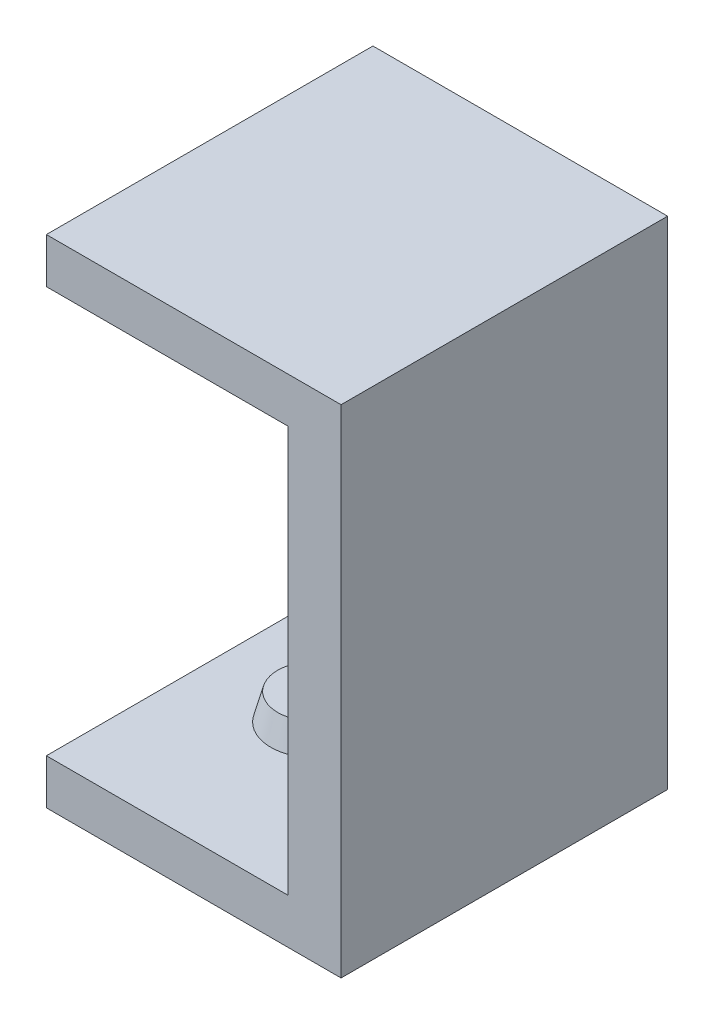
ISO-10303-21;
HEADER;
FILE_DESCRIPTION(('STEP AP214'),'2;1');
FILE_NAME('part.step','',(''),(''),'','','');
FILE_SCHEMA(('AUTOMOTIVE_DESIGN { 1 0 10303 214 1 1 1 1 }'));
ENDSEC;
DATA;
#1=APPLICATION_CONTEXT('core data for automotive mechanical design processes');
#2=APPLICATION_PROTOCOL_DEFINITION('international standard','automotive_design',2000,#1);
#3=PRODUCT_CONTEXT('',#1,'mechanical');
#4=PRODUCT('Part','Part','',(#3));
#5=PRODUCT_RELATED_PRODUCT_CATEGORY('part','',(#4));
#6=PRODUCT_DEFINITION_FORMATION('','',#4);
#7=PRODUCT_DEFINITION_CONTEXT('part definition',#1,'design');
#8=PRODUCT_DEFINITION('design','',#6,#7);
#9=PRODUCT_DEFINITION_SHAPE('','',#8);
#10=(LENGTH_UNIT() NAMED_UNIT(*) SI_UNIT(.MILLI.,.METRE.));
#11=(NAMED_UNIT(*) PLANE_ANGLE_UNIT() SI_UNIT($,.RADIAN.));
#12=(NAMED_UNIT(*) SI_UNIT($,.STERADIAN.) SOLID_ANGLE_UNIT());
#13=UNCERTAINTY_MEASURE_WITH_UNIT(LENGTH_MEASURE(1.E-05),#10,'distance_accuracy_value','');
#14=(GEOMETRIC_REPRESENTATION_CONTEXT(3) GLOBAL_UNCERTAINTY_ASSIGNED_CONTEXT((#13)) GLOBAL_UNIT_ASSIGNED_CONTEXT((#10,
#11,#12)) REPRESENTATION_CONTEXT('',''));
#15=CARTESIAN_POINT('',(0.,0.,0.));
#16=DIRECTION('',(0.,0.,1.));
#17=DIRECTION('',(1.,0.,0.));
#18=AXIS2_PLACEMENT_3D('',#15,#16,#17);
#19=CARTESIAN_POINT('',(0.,7.65,12.3));
#20=DIRECTION('',(0.,-1.,0.));
#21=DIRECTION('',(1.,0.,0.));
#22=AXIS2_PLACEMENT_3D('',#19,#20,#21);
#23=PLANE('',#22);
#24=DIRECTION('',(-1.,0.,0.));
#25=VECTOR('',#24,1.);
#26=CARTESIAN_POINT('',(0.,7.65,0.));
#27=LINE('',#26,#25);
#28=CARTESIAN_POINT('',(0.,7.65,0.));
#29=VERTEX_POINT('',#28);
#30=CARTESIAN_POINT('',(-9.1,7.65,0.));
#31=VERTEX_POINT('',#30);
#32=EDGE_CURVE('E142',#29,#31,#27,.T.);
#33=ORIENTED_EDGE('',*,*,#32,.F.);
#34=DIRECTION('',(0.,0.,-1.));
#35=VECTOR('',#34,1.);
#36=CARTESIAN_POINT('',(0.,7.65,12.3));
#37=LINE('',#36,#35);
#38=CARTESIAN_POINT('',(0.,7.65,12.3));
#39=VERTEX_POINT('',#38);
#40=EDGE_CURVE('E155',#39,#29,#37,.T.);
#41=ORIENTED_EDGE('',*,*,#40,.F.);
#42=DIRECTION('',(-1.,0.,0.));
#43=VECTOR('',#42,1.);
#44=CARTESIAN_POINT('',(0.,7.65,12.3));
#45=LINE('',#44,#43);
#46=CARTESIAN_POINT('',(-9.1,7.65,12.3));
#47=VERTEX_POINT('',#46);
#48=EDGE_CURVE('E212',#39,#47,#45,.T.);
#49=ORIENTED_EDGE('',*,*,#48,.T.);
#50=DIRECTION('',(0.,0.,-1.));
#51=VECTOR('',#50,1.);
#52=CARTESIAN_POINT('',(-9.1,7.65,12.3));
#53=LINE('',#52,#51);
#54=EDGE_CURVE('E157',#47,#31,#53,.T.);
#55=ORIENTED_EDGE('',*,*,#54,.T.);
#56=EDGE_LOOP('',(#33,#41,#49,#55));
#57=FACE_BOUND('',#56,.T.);
#58=CARTESIAN_POINT('',(-5.15,7.65,6.15));
#59=DIRECTION('',(0.,-1.,0.));
#60=DIRECTION('',(0.,0.,-1.));
#61=AXIS2_PLACEMENT_3D('',#58,#59,#60);
#62=CIRCLE('',#61,1.65);
#63=CARTESIAN_POINT('',(-5.15,7.65,4.5));
#64=VERTEX_POINT('',#63);
#65=EDGE_CURVE('E137',#64,#64,#62,.T.);
#66=ORIENTED_EDGE('',*,*,#65,.F.);
#67=EDGE_LOOP('',(#66));
#68=FACE_BOUND('',#67,.T.);
#69=ADVANCED_FACE('F35',(#57,#68),#23,.T.);
#70=CARTESIAN_POINT('',(2.,0.,12.3));
#71=DIRECTION('',(1.,0.,0.));
#72=DIRECTION('',(0.,0.,-1.));
#73=AXIS2_PLACEMENT_3D('',#70,#71,#72);
#74=PLANE('',#73);
#75=DIRECTION('',(0.,-1.,0.));
#76=VECTOR('',#75,1.);
#77=CARTESIAN_POINT('',(2.,0.,0.));
#78=LINE('',#77,#76);
#79=CARTESIAN_POINT('',(2.,9.35,0.));
#80=VERTEX_POINT('',#79);
#81=CARTESIAN_POINT('',(2.,-9.35,0.));
#82=VERTEX_POINT('',#81);
#83=EDGE_CURVE('E89',#80,#82,#78,.T.);
#84=ORIENTED_EDGE('',*,*,#83,.F.);
#85=DIRECTION('',(0.,0.,-1.));
#86=VECTOR('',#85,1.);
#87=CARTESIAN_POINT('',(2.,9.35,12.3));
#88=LINE('',#87,#86);
#89=CARTESIAN_POINT('',(2.,9.35,12.3));
#90=VERTEX_POINT('',#89);
#91=EDGE_CURVE('E161',#90,#80,#88,.T.);
#92=ORIENTED_EDGE('',*,*,#91,.F.);
#93=DIRECTION('',(0.,-1.,0.));
#94=VECTOR('',#93,1.);
#95=CARTESIAN_POINT('',(2.,0.,12.3));
#96=LINE('',#95,#94);
#97=CARTESIAN_POINT('',(2.,-9.35,12.3));
#98=VERTEX_POINT('',#97);
#99=EDGE_CURVE('E95',#90,#98,#96,.T.);
#100=ORIENTED_EDGE('',*,*,#99,.T.);
#101=DIRECTION('',(0.,0.,-1.));
#102=VECTOR('',#101,1.);
#103=CARTESIAN_POINT('',(2.,-9.35,12.3));
#104=LINE('',#103,#102);
#105=EDGE_CURVE('E131',#98,#82,#104,.T.);
#106=ORIENTED_EDGE('',*,*,#105,.T.);
#107=EDGE_LOOP('',(#84,#92,#100,#106));
#108=FACE_BOUND('',#107,.T.);
#109=ADVANCED_FACE('F182',(#108),#74,.T.);
#110=CARTESIAN_POINT('',(0.,9.35,12.3));
#111=DIRECTION('',(0.,1.,0.));
#112=DIRECTION('',(0.,0.,1.));
#113=AXIS2_PLACEMENT_3D('',#110,#111,#112);
#114=PLANE('',#113);
#115=DIRECTION('',(1.,0.,0.));
#116=VECTOR('',#115,1.);
#117=CARTESIAN_POINT('',(0.,9.35,0.));
#118=LINE('',#117,#116);
#119=CARTESIAN_POINT('',(-9.1,9.35,0.));
#120=VERTEX_POINT('',#119);
#121=EDGE_CURVE('E136',#120,#80,#118,.T.);
#122=ORIENTED_EDGE('',*,*,#121,.F.);
#123=DIRECTION('',(0.,0.,-1.));
#124=VECTOR('',#123,1.);
#125=CARTESIAN_POINT('',(-9.1,9.35,12.3));
#126=LINE('',#125,#124);
#127=CARTESIAN_POINT('',(-9.1,9.35,12.3));
#128=VERTEX_POINT('',#127);
#129=EDGE_CURVE('E159',#128,#120,#126,.T.);
#130=ORIENTED_EDGE('',*,*,#129,.F.);
#131=DIRECTION('',(1.,0.,0.));
#132=VECTOR('',#131,1.);
#133=CARTESIAN_POINT('',(0.,9.35,12.3));
#134=LINE('',#133,#132);
#135=EDGE_CURVE('E213',#128,#90,#134,.T.);
#136=ORIENTED_EDGE('',*,*,#135,.T.);
#137=ORIENTED_EDGE('',*,*,#91,.T.);
#138=EDGE_LOOP('',(#122,#130,#136,#137));
#139=FACE_BOUND('',#138,.T.);
#140=ADVANCED_FACE('F188',(#139),#114,.T.);
#141=CARTESIAN_POINT('',(-9.1,0.,12.3));
#142=DIRECTION('',(1.,0.,0.));
#143=DIRECTION('',(0.,0.,-1.));
#144=AXIS2_PLACEMENT_3D('',#141,#142,#143);
#145=PLANE('',#144);
#146=DIRECTION('',(0.,-1.,0.));
#147=VECTOR('',#146,1.);
#148=CARTESIAN_POINT('',(-9.1,0.,0.));
#149=LINE('',#148,#147);
#150=EDGE_CURVE('E139',#120,#31,#149,.T.);
#151=ORIENTED_EDGE('',*,*,#150,.T.);
#152=ORIENTED_EDGE('',*,*,#54,.F.);
#153=DIRECTION('',(0.,-1.,0.));
#154=VECTOR('',#153,1.);
#155=CARTESIAN_POINT('',(-9.1,0.,12.3));
#156=LINE('',#155,#154);
#157=EDGE_CURVE('E211',#128,#47,#156,.T.);
#158=ORIENTED_EDGE('',*,*,#157,.F.);
#159=ORIENTED_EDGE('',*,*,#129,.T.);
#160=EDGE_LOOP('',(#151,#152,#158,#159));
#161=FACE_BOUND('',#160,.T.);
#162=ADVANCED_FACE('F196',(#161),#145,.F.);
#163=CARTESIAN_POINT('',(0.,0.,12.3));
#164=DIRECTION('',(1.,0.,0.));
#165=DIRECTION('',(0.,0.,-1.));
#166=AXIS2_PLACEMENT_3D('',#163,#164,#165);
#167=PLANE('',#166);
#168=DIRECTION('',(0.,-1.,0.));
#169=VECTOR('',#168,1.);
#170=CARTESIAN_POINT('',(0.,0.,0.));
#171=LINE('',#170,#169);
#172=CARTESIAN_POINT('',(0.,-7.65,0.));
#173=VERTEX_POINT('',#172);
#174=EDGE_CURVE('E145',#29,#173,#171,.T.);
#175=ORIENTED_EDGE('',*,*,#174,.T.);
#176=DIRECTION('',(0.,0.,-1.));
#177=VECTOR('',#176,1.);
#178=CARTESIAN_POINT('',(0.,-7.65,12.3));
#179=LINE('',#178,#177);
#180=CARTESIAN_POINT('',(0.,-7.65,12.3));
#181=VERTEX_POINT('',#180);
#182=EDGE_CURVE('E126',#181,#173,#179,.T.);
#183=ORIENTED_EDGE('',*,*,#182,.F.);
#184=DIRECTION('',(0.,-1.,0.));
#185=VECTOR('',#184,1.);
#186=CARTESIAN_POINT('',(0.,0.,12.3));
#187=LINE('',#186,#185);
#188=EDGE_CURVE('E117',#39,#181,#187,.T.);
#189=ORIENTED_EDGE('',*,*,#188,.F.);
#190=ORIENTED_EDGE('',*,*,#40,.T.);
#191=EDGE_LOOP('',(#175,#183,#189,#190));
#192=FACE_BOUND('',#191,.T.);
#193=ADVANCED_FACE('F194',(#192),#167,.F.);
#194=CARTESIAN_POINT('',(0.,-7.65,12.3));
#195=DIRECTION('',(0.,-1.,0.));
#196=DIRECTION('',(1.,0.,0.));
#197=AXIS2_PLACEMENT_3D('',#194,#195,#196);
#198=PLANE('',#197);
#199=CARTESIAN_POINT('',(-5.15,-7.65,6.15));
#200=DIRECTION('',(0.,-1.,0.));
#201=DIRECTION('',(0.,0.,-1.));
#202=AXIS2_PLACEMENT_3D('',#199,#200,#201);
#203=CIRCLE('',#202,1.65);
#204=CARTESIAN_POINT('',(-5.15,-7.65,4.5));
#205=VERTEX_POINT('',#204);
#206=EDGE_CURVE('E238',#205,#205,#203,.T.);
#207=ORIENTED_EDGE('',*,*,#206,.T.);
#208=EDGE_LOOP('',(#207));
#209=FACE_BOUND('',#208,.T.);
#210=DIRECTION('',(-1.,0.,0.));
#211=VECTOR('',#210,1.);
#212=CARTESIAN_POINT('',(0.,-7.65,0.));
#213=LINE('',#212,#211);
#214=CARTESIAN_POINT('',(-9.1,-7.65,0.));
#215=VERTEX_POINT('',#214);
#216=EDGE_CURVE('E125',#173,#215,#213,.T.);
#217=ORIENTED_EDGE('',*,*,#216,.T.);
#218=DIRECTION('',(0.,0.,-1.));
#219=VECTOR('',#218,1.);
#220=CARTESIAN_POINT('',(-9.1,-7.65,12.3));
#221=LINE('',#220,#219);
#222=CARTESIAN_POINT('',(-9.1,-7.65,12.3));
#223=VERTEX_POINT('',#222);
#224=EDGE_CURVE('E122',#223,#215,#221,.T.);
#225=ORIENTED_EDGE('',*,*,#224,.F.);
#226=DIRECTION('',(-1.,0.,0.));
#227=VECTOR('',#226,1.);
#228=CARTESIAN_POINT('',(0.,-7.65,12.3));
#229=LINE('',#228,#227);
#230=EDGE_CURVE('E110',#181,#223,#229,.T.);
#231=ORIENTED_EDGE('',*,*,#230,.F.);
#232=ORIENTED_EDGE('',*,*,#182,.T.);
#233=EDGE_LOOP('',(#217,#225,#231,#232));
#234=FACE_BOUND('',#233,.T.);
#235=ADVANCED_FACE('F123',(#209,#234),#198,.F.);
#236=CARTESIAN_POINT('',(-9.1,0.,12.3));
#237=DIRECTION('',(1.,0.,0.));
#238=DIRECTION('',(0.,0.,-1.));
#239=AXIS2_PLACEMENT_3D('',#236,#237,#238);
#240=PLANE('',#239);
#241=DIRECTION('',(0.,-1.,0.));
#242=VECTOR('',#241,1.);
#243=CARTESIAN_POINT('',(-9.1,0.,0.));
#244=LINE('',#243,#242);
#245=CARTESIAN_POINT('',(-9.1,-9.35,0.));
#246=VERTEX_POINT('',#245);
#247=EDGE_CURVE('E81',#215,#246,#244,.T.);
#248=ORIENTED_EDGE('',*,*,#247,.T.);
#249=DIRECTION('',(0.,0.,-1.));
#250=VECTOR('',#249,1.);
#251=CARTESIAN_POINT('',(-9.1,-9.35,12.3));
#252=LINE('',#251,#250);
#253=CARTESIAN_POINT('',(-9.1,-9.35,12.3));
#254=VERTEX_POINT('',#253);
#255=EDGE_CURVE('E127',#254,#246,#252,.T.);
#256=ORIENTED_EDGE('',*,*,#255,.F.);
#257=DIRECTION('',(0.,-1.,0.));
#258=VECTOR('',#257,1.);
#259=CARTESIAN_POINT('',(-9.1,0.,12.3));
#260=LINE('',#259,#258);
#261=EDGE_CURVE('E114',#223,#254,#260,.T.);
#262=ORIENTED_EDGE('',*,*,#261,.F.);
#263=ORIENTED_EDGE('',*,*,#224,.T.);
#264=EDGE_LOOP('',(#248,#256,#262,#263));
#265=FACE_BOUND('',#264,.T.);
#266=ADVANCED_FACE('F129',(#265),#240,.F.);
#267=CARTESIAN_POINT('',(0.,-9.35,12.3));
#268=DIRECTION('',(0.,1.,0.));
#269=DIRECTION('',(0.,0.,1.));
#270=AXIS2_PLACEMENT_3D('',#267,#268,#269);
#271=PLANE('',#270);
#272=DIRECTION('',(1.,0.,0.));
#273=VECTOR('',#272,1.);
#274=CARTESIAN_POINT('',(0.,-9.35,0.));
#275=LINE('',#274,#273);
#276=EDGE_CURVE('E149',#246,#82,#275,.T.);
#277=ORIENTED_EDGE('',*,*,#276,.T.);
#278=ORIENTED_EDGE('',*,*,#105,.F.);
#279=DIRECTION('',(1.,0.,0.));
#280=VECTOR('',#279,1.);
#281=CARTESIAN_POINT('',(0.,-9.35,12.3));
#282=LINE('',#281,#280);
#283=EDGE_CURVE('E52',#254,#98,#282,.T.);
#284=ORIENTED_EDGE('',*,*,#283,.F.);
#285=ORIENTED_EDGE('',*,*,#255,.T.);
#286=EDGE_LOOP('',(#277,#278,#284,#285));
#287=FACE_BOUND('',#286,.T.);
#288=ADVANCED_FACE('F221',(#287),#271,.F.);
#289=CARTESIAN_POINT('',(0.,0.,12.3));
#290=DIRECTION('',(0.,0.,1.));
#291=DIRECTION('',(1.,0.,0.));
#292=AXIS2_PLACEMENT_3D('',#289,#290,#291);
#293=PLANE('',#292);
#294=ORIENTED_EDGE('',*,*,#99,.F.);
#295=ORIENTED_EDGE('',*,*,#135,.F.);
#296=ORIENTED_EDGE('',*,*,#157,.T.);
#297=ORIENTED_EDGE('',*,*,#48,.F.);
#298=ORIENTED_EDGE('',*,*,#188,.T.);
#299=ORIENTED_EDGE('',*,*,#230,.T.);
#300=ORIENTED_EDGE('',*,*,#261,.T.);
#301=ORIENTED_EDGE('',*,*,#283,.T.);
#302=EDGE_LOOP('',(#294,#295,#296,#297,#298,#299,#300,#301));
#303=FACE_BOUND('',#302,.T.);
#304=ADVANCED_FACE('F112',(#303),#293,.T.);
#305=CARTESIAN_POINT('',(0.,0.,0.));
#306=DIRECTION('',(0.,0.,1.));
#307=DIRECTION('',(1.,0.,0.));
#308=AXIS2_PLACEMENT_3D('',#305,#306,#307);
#309=PLANE('',#308);
#310=ORIENTED_EDGE('',*,*,#83,.T.);
#311=ORIENTED_EDGE('',*,*,#276,.F.);
#312=ORIENTED_EDGE('',*,*,#247,.F.);
#313=ORIENTED_EDGE('',*,*,#216,.F.);
#314=ORIENTED_EDGE('',*,*,#174,.F.);
#315=ORIENTED_EDGE('',*,*,#32,.T.);
#316=ORIENTED_EDGE('',*,*,#150,.F.);
#317=ORIENTED_EDGE('',*,*,#121,.T.);
#318=EDGE_LOOP('',(#310,#311,#312,#313,#314,#315,#316,#317));
#319=FACE_BOUND('',#318,.T.);
#320=ADVANCED_FACE('F177',(#319),#309,.F.);
#321=CARTESIAN_POINT('',(-5.15,6.65,6.15));
#322=DIRECTION('',(0.,-1.,0.));
#323=DIRECTION('',(0.,0.,-1.));
#324=AXIS2_PLACEMENT_3D('',#321,#322,#323);
#325=PLANE('',#324);
#326=CARTESIAN_POINT('',(-5.15,6.65,6.15));
#327=DIRECTION('',(0.,-1.,0.));
#328=DIRECTION('',(0.,0.,-1.));
#329=AXIS2_PLACEMENT_3D('',#326,#327,#328);
#330=CIRCLE('',#329,1.38205080756888);
#331=CARTESIAN_POINT('',(-5.15,6.65,4.76794919243112));
#332=VERTEX_POINT('',#331);
#333=EDGE_CURVE('E44',#332,#332,#330,.T.);
#334=ORIENTED_EDGE('',*,*,#333,.T.);
#335=EDGE_LOOP('',(#334));
#336=FACE_BOUND('',#335,.T.);
#337=ADVANCED_FACE('F165',(#336),#325,.T.);
#338=CARTESIAN_POINT('',(-5.15,6.65,6.15));
#339=DIRECTION('',(0.,1.,0.));
#340=DIRECTION('',(0.,0.,1.));
#341=AXIS2_PLACEMENT_3D('',#338,#339,#340);
#342=CONICAL_SURFACE('',#341,1.38205080756888,0.261799387799146);
#343=ORIENTED_EDGE('',*,*,#65,.T.);
#344=EDGE_LOOP('',(#343));
#345=FACE_BOUND('',#344,.T.);
#346=ORIENTED_EDGE('',*,*,#333,.F.);
#347=EDGE_LOOP('',(#346));
#348=FACE_BOUND('',#347,.T.);
#349=ADVANCED_FACE('F167',(#345,#348),#342,.T.);
#350=CARTESIAN_POINT('',(-5.15,-6.65,6.15));
#351=DIRECTION('',(0.,1.,0.));
#352=DIRECTION('',(0.,0.,-1.));
#353=AXIS2_PLACEMENT_3D('',#350,#351,#352);
#354=PLANE('',#353);
#355=CARTESIAN_POINT('',(-5.15,-6.65,6.15));
#356=DIRECTION('',(0.,1.,0.));
#357=DIRECTION('',(0.,0.,1.));
#358=AXIS2_PLACEMENT_3D('',#355,#356,#357);
#359=CIRCLE('',#358,1.38205080756888);
#360=CARTESIAN_POINT('',(-5.15,-6.65,7.53205080756888));
#361=VERTEX_POINT('',#360);
#362=EDGE_CURVE('E11',#361,#361,#359,.T.);
#363=ORIENTED_EDGE('',*,*,#362,.T.);
#364=EDGE_LOOP('',(#363));
#365=FACE_BOUND('',#364,.T.);
#366=ADVANCED_FACE('F169',(#365),#354,.T.);
#367=CARTESIAN_POINT('',(-5.15,-7.65000000000002,6.15));
#368=DIRECTION('',(0.,-1.,0.));
#369=DIRECTION('',(0.,0.,-1.));
#370=AXIS2_PLACEMENT_3D('',#367,#368,#369);
#371=CONICAL_SURFACE('',#370,1.65,0.261799387799146);
#372=ORIENTED_EDGE('',*,*,#362,.F.);
#373=EDGE_LOOP('',(#372));
#374=FACE_BOUND('',#373,.T.);
#375=ORIENTED_EDGE('',*,*,#206,.F.);
#376=EDGE_LOOP('',(#375));
#377=FACE_BOUND('',#376,.T.);
#378=ADVANCED_FACE('F37',(#374,#377),#371,.T.);
#379=CLOSED_SHELL('',(#69,#109,#140,#162,#193,#235,#266,#288,#304,#320,#337,#349,#366,#378));
#380=MANIFOLD_SOLID_BREP('B2',#379);
#381=ADVANCED_BREP_SHAPE_REPRESENTATION('',(#18,#380),#14);
#382=SHAPE_DEFINITION_REPRESENTATION(#9,#381);
ENDSEC;
END-ISO-10303-21;
